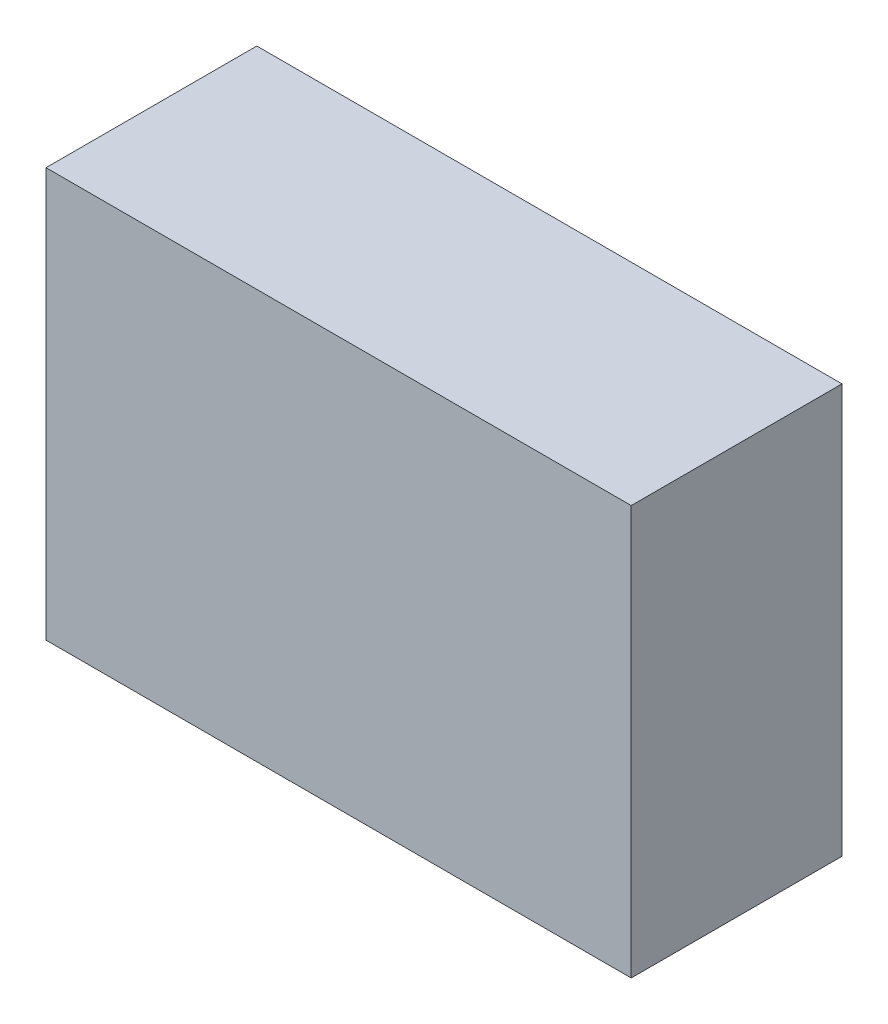
ISO-10303-21;
HEADER;
FILE_DESCRIPTION(('STEP AP214'),'2;1');
FILE_NAME('part.step','',(''),(''),'','','');
FILE_SCHEMA(('AUTOMOTIVE_DESIGN { 1 0 10303 214 1 1 1 1 }'));
ENDSEC;
DATA;
#1=APPLICATION_CONTEXT('core data for automotive mechanical design processes');
#2=APPLICATION_PROTOCOL_DEFINITION('international standard','automotive_design',2000,#1);
#3=PRODUCT_CONTEXT('',#1,'mechanical');
#4=PRODUCT('Part','Part','',(#3));
#5=PRODUCT_RELATED_PRODUCT_CATEGORY('part','',(#4));
#6=PRODUCT_DEFINITION_FORMATION('','',#4);
#7=PRODUCT_DEFINITION_CONTEXT('part definition',#1,'design');
#8=PRODUCT_DEFINITION('design','',#6,#7);
#9=PRODUCT_DEFINITION_SHAPE('','',#8);
#10=(LENGTH_UNIT() NAMED_UNIT(*) SI_UNIT(.MILLI.,.METRE.));
#11=(NAMED_UNIT(*) PLANE_ANGLE_UNIT() SI_UNIT($,.RADIAN.));
#12=(NAMED_UNIT(*) SI_UNIT($,.STERADIAN.) SOLID_ANGLE_UNIT());
#13=UNCERTAINTY_MEASURE_WITH_UNIT(LENGTH_MEASURE(1.E-05),#10,'distance_accuracy_value','');
#14=(GEOMETRIC_REPRESENTATION_CONTEXT(3) GLOBAL_UNCERTAINTY_ASSIGNED_CONTEXT((#13)) GLOBAL_UNIT_ASSIGNED_CONTEXT((#10,
#11,#12)) REPRESENTATION_CONTEXT('',''));
#15=CARTESIAN_POINT('',(0.,0.,0.));
#16=DIRECTION('',(0.,0.,1.));
#17=DIRECTION('',(1.,0.,0.));
#18=AXIS2_PLACEMENT_3D('',#15,#16,#17);
#19=CARTESIAN_POINT('',(0.,0.,21.59));
#20=DIRECTION('',(1.,0.,0.));
#21=DIRECTION('',(0.,0.,-1.));
#22=AXIS2_PLACEMENT_3D('',#19,#20,#21);
#23=PLANE('',#22);
#24=DIRECTION('',(0.,-1.,0.));
#25=VECTOR('',#24,1.);
#26=CARTESIAN_POINT('',(0.,0.,0.));
#27=LINE('',#26,#25);
#28=CARTESIAN_POINT('',(0.,41.91,0.));
#29=VERTEX_POINT('',#28);
#30=CARTESIAN_POINT('',(0.,0.,0.));
#31=VERTEX_POINT('',#30);
#32=EDGE_CURVE('E102',#29,#31,#27,.T.);
#33=ORIENTED_EDGE('',*,*,#32,.T.);
#34=DIRECTION('',(0.,0.,-1.));
#35=VECTOR('',#34,1.);
#36=CARTESIAN_POINT('',(0.,0.,21.59));
#37=LINE('',#36,#35);
#38=CARTESIAN_POINT('',(0.,0.,21.59));
#39=VERTEX_POINT('',#38);
#40=EDGE_CURVE('E11',#39,#31,#37,.T.);
#41=ORIENTED_EDGE('',*,*,#40,.F.);
#42=DIRECTION('',(0.,-1.,0.));
#43=VECTOR('',#42,1.);
#44=CARTESIAN_POINT('',(0.,0.,21.59));
#45=LINE('',#44,#43);
#46=CARTESIAN_POINT('',(0.,41.91,21.59));
#47=VERTEX_POINT('',#46);
#48=EDGE_CURVE('E90',#47,#39,#45,.T.);
#49=ORIENTED_EDGE('',*,*,#48,.F.);
#50=DIRECTION('',(0.,0.,-1.));
#51=VECTOR('',#50,1.);
#52=CARTESIAN_POINT('',(0.,41.91,21.59));
#53=LINE('',#52,#51);
#54=EDGE_CURVE('E98',#47,#29,#53,.T.);
#55=ORIENTED_EDGE('',*,*,#54,.T.);
#56=EDGE_LOOP('',(#33,#41,#49,#55));
#57=FACE_BOUND('',#56,.T.);
#58=ADVANCED_FACE('F39',(#57),#23,.F.);
#59=CARTESIAN_POINT('',(0.,0.,21.59));
#60=DIRECTION('',(0.,1.,0.));
#61=DIRECTION('',(0.,0.,1.));
#62=AXIS2_PLACEMENT_3D('',#59,#60,#61);
#63=PLANE('',#62);
#64=DIRECTION('',(1.,0.,0.));
#65=VECTOR('',#64,1.);
#66=CARTESIAN_POINT('',(0.,0.,0.));
#67=LINE('',#66,#65);
#68=CARTESIAN_POINT('',(59.944,0.,0.));
#69=VERTEX_POINT('',#68);
#70=EDGE_CURVE('E94',#31,#69,#67,.T.);
#71=ORIENTED_EDGE('',*,*,#70,.T.);
#72=DIRECTION('',(0.,0.,-1.));
#73=VECTOR('',#72,1.);
#74=CARTESIAN_POINT('',(59.944,0.,21.59));
#75=LINE('',#74,#73);
#76=CARTESIAN_POINT('',(59.944,0.,21.59));
#77=VERTEX_POINT('',#76);
#78=EDGE_CURVE('E47',#77,#69,#75,.T.);
#79=ORIENTED_EDGE('',*,*,#78,.F.);
#80=DIRECTION('',(1.,0.,0.));
#81=VECTOR('',#80,1.);
#82=CARTESIAN_POINT('',(0.,0.,21.59));
#83=LINE('',#82,#81);
#84=EDGE_CURVE('E85',#39,#77,#83,.T.);
#85=ORIENTED_EDGE('',*,*,#84,.F.);
#86=ORIENTED_EDGE('',*,*,#40,.T.);
#87=EDGE_LOOP('',(#71,#79,#85,#86));
#88=FACE_BOUND('',#87,.T.);
#89=ADVANCED_FACE('F93',(#88),#63,.F.);
#90=CARTESIAN_POINT('',(59.944,0.,21.59));
#91=DIRECTION('',(-1.,0.,0.));
#92=DIRECTION('',(0.,0.,1.));
#93=AXIS2_PLACEMENT_3D('',#90,#91,#92);
#94=PLANE('',#93);
#95=DIRECTION('',(0.,1.,0.));
#96=VECTOR('',#95,1.);
#97=CARTESIAN_POINT('',(59.944,0.,0.));
#98=LINE('',#97,#96);
#99=CARTESIAN_POINT('',(59.944,41.91,0.));
#100=VERTEX_POINT('',#99);
#101=EDGE_CURVE('E72',#69,#100,#98,.T.);
#102=ORIENTED_EDGE('',*,*,#101,.T.);
#103=DIRECTION('',(0.,0.,-1.));
#104=VECTOR('',#103,1.);
#105=CARTESIAN_POINT('',(59.944,41.91,21.59));
#106=LINE('',#105,#104);
#107=CARTESIAN_POINT('',(59.944,41.91,21.59));
#108=VERTEX_POINT('',#107);
#109=EDGE_CURVE('E95',#108,#100,#106,.T.);
#110=ORIENTED_EDGE('',*,*,#109,.F.);
#111=DIRECTION('',(0.,1.,0.));
#112=VECTOR('',#111,1.);
#113=CARTESIAN_POINT('',(59.944,0.,21.59));
#114=LINE('',#113,#112);
#115=EDGE_CURVE('E88',#77,#108,#114,.T.);
#116=ORIENTED_EDGE('',*,*,#115,.F.);
#117=ORIENTED_EDGE('',*,*,#78,.T.);
#118=EDGE_LOOP('',(#102,#110,#116,#117));
#119=FACE_BOUND('',#118,.T.);
#120=ADVANCED_FACE('F96',(#119),#94,.F.);
#121=CARTESIAN_POINT('',(0.,41.91,21.59));
#122=DIRECTION('',(0.,-1.,0.));
#123=DIRECTION('',(0.,0.,-1.));
#124=AXIS2_PLACEMENT_3D('',#121,#122,#123);
#125=PLANE('',#124);
#126=DIRECTION('',(-1.,0.,0.));
#127=VECTOR('',#126,1.);
#128=CARTESIAN_POINT('',(0.,41.91,0.));
#129=LINE('',#128,#127);
#130=EDGE_CURVE('E78',#100,#29,#129,.T.);
#131=ORIENTED_EDGE('',*,*,#130,.T.);
#132=ORIENTED_EDGE('',*,*,#54,.F.);
#133=DIRECTION('',(-1.,0.,0.));
#134=VECTOR('',#133,1.);
#135=CARTESIAN_POINT('',(0.,41.91,21.59));
#136=LINE('',#135,#134);
#137=EDGE_CURVE('E55',#108,#47,#136,.T.);
#138=ORIENTED_EDGE('',*,*,#137,.F.);
#139=ORIENTED_EDGE('',*,*,#109,.T.);
#140=EDGE_LOOP('',(#131,#132,#138,#139));
#141=FACE_BOUND('',#140,.T.);
#142=ADVANCED_FACE('F109',(#141),#125,.F.);
#143=CARTESIAN_POINT('',(0.,0.,21.59));
#144=DIRECTION('',(0.,0.,-1.));
#145=DIRECTION('',(-1.,0.,0.));
#146=AXIS2_PLACEMENT_3D('',#143,#144,#145);
#147=PLANE('',#146);
#148=ORIENTED_EDGE('',*,*,#48,.T.);
#149=ORIENTED_EDGE('',*,*,#84,.T.);
#150=ORIENTED_EDGE('',*,*,#115,.T.);
#151=ORIENTED_EDGE('',*,*,#137,.T.);
#152=EDGE_LOOP('',(#148,#149,#150,#151));
#153=FACE_BOUND('',#152,.T.);
#154=ADVANCED_FACE('F86',(#153),#147,.F.);
#155=CARTESIAN_POINT('',(0.,0.,0.));
#156=DIRECTION('',(0.,0.,-1.));
#157=DIRECTION('',(-1.,0.,0.));
#158=AXIS2_PLACEMENT_3D('',#155,#156,#157);
#159=PLANE('',#158);
#160=ORIENTED_EDGE('',*,*,#32,.F.);
#161=ORIENTED_EDGE('',*,*,#130,.F.);
#162=ORIENTED_EDGE('',*,*,#101,.F.);
#163=ORIENTED_EDGE('',*,*,#70,.F.);
#164=EDGE_LOOP('',(#160,#161,#162,#163));
#165=FACE_BOUND('',#164,.T.);
#166=ADVANCED_FACE('F112',(#165),#159,.T.);
#167=CLOSED_SHELL('',(#58,#89,#120,#142,#154,#166));
#168=MANIFOLD_SOLID_BREP('B2',#167);
#169=ADVANCED_BREP_SHAPE_REPRESENTATION('',(#18,#168),#14);
#170=SHAPE_DEFINITION_REPRESENTATION(#9,#169);
ENDSEC;
END-ISO-10303-21;
